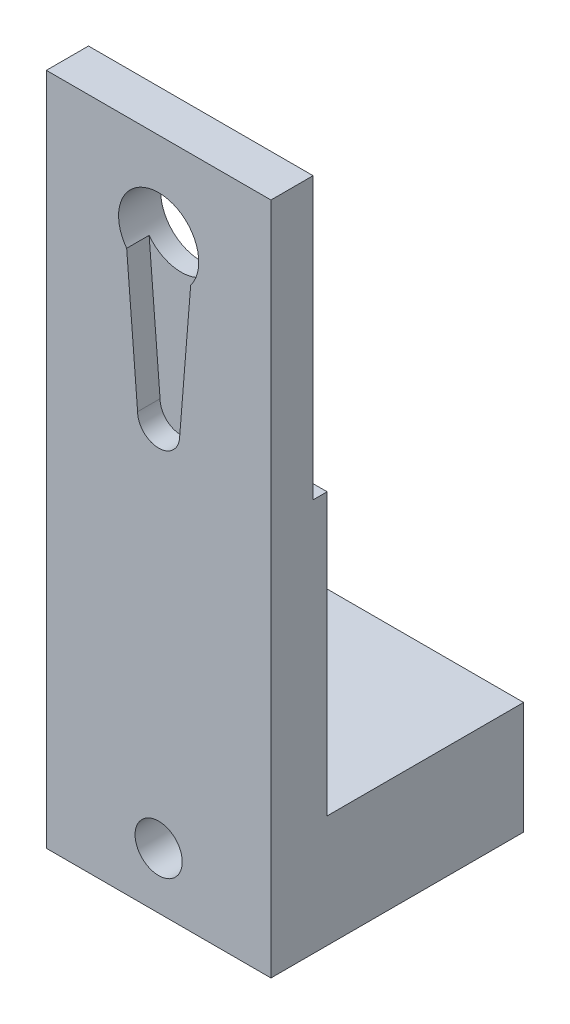
ISO-10303-21;
HEADER;
FILE_DESCRIPTION(('STEP AP214'),'2;1');
FILE_NAME('part.step','',(''),(''),'','','');
FILE_SCHEMA(('AUTOMOTIVE_DESIGN { 1 0 10303 214 1 1 1 1 }'));
ENDSEC;
DATA;
#1=APPLICATION_CONTEXT('core data for automotive mechanical design processes');
#2=APPLICATION_PROTOCOL_DEFINITION('international standard','automotive_design',2000,#1);
#3=PRODUCT_CONTEXT('',#1,'mechanical');
#4=PRODUCT('Part','Part','',(#3));
#5=PRODUCT_RELATED_PRODUCT_CATEGORY('part','',(#4));
#6=PRODUCT_DEFINITION_FORMATION('','',#4);
#7=PRODUCT_DEFINITION_CONTEXT('part definition',#1,'design');
#8=PRODUCT_DEFINITION('design','',#6,#7);
#9=PRODUCT_DEFINITION_SHAPE('','',#8);
#10=(LENGTH_UNIT() NAMED_UNIT(*) SI_UNIT(.MILLI.,.METRE.));
#11=(NAMED_UNIT(*) PLANE_ANGLE_UNIT() SI_UNIT($,.RADIAN.));
#12=(NAMED_UNIT(*) SI_UNIT($,.STERADIAN.) SOLID_ANGLE_UNIT());
#13=UNCERTAINTY_MEASURE_WITH_UNIT(LENGTH_MEASURE(1.E-05),#10,'distance_accuracy_value','');
#14=(GEOMETRIC_REPRESENTATION_CONTEXT(3) GLOBAL_UNCERTAINTY_ASSIGNED_CONTEXT((#13)) GLOBAL_UNIT_ASSIGNED_CONTEXT((#10,
#11,#12)) REPRESENTATION_CONTEXT('',''));
#15=CARTESIAN_POINT('',(0.,0.,0.));
#16=DIRECTION('',(0.,0.,1.));
#17=DIRECTION('',(1.,0.,0.));
#18=AXIS2_PLACEMENT_3D('',#15,#16,#17);
#19=CARTESIAN_POINT('',(0.,0.,0.));
#20=DIRECTION('',(0.,0.,1.));
#21=DIRECTION('',(1.,0.,0.));
#22=AXIS2_PLACEMENT_3D('',#19,#20,#21);
#23=PLANE('',#22);
#24=DIRECTION('',(0.,-1.,0.));
#25=VECTOR('',#24,1.);
#26=CARTESIAN_POINT('',(-10.,30.,0.));
#27=LINE('',#26,#25);
#28=CARTESIAN_POINT('',(-10.,4.99999999999999,0.));
#29=VERTEX_POINT('',#28);
#30=CARTESIAN_POINT('',(-10.,-20.,0.));
#31=VERTEX_POINT('',#30);
#32=EDGE_CURVE('E69',#29,#31,#27,.T.);
#33=ORIENTED_EDGE('',*,*,#32,.F.);
#34=DIRECTION('',(1.,0.,0.));
#35=VECTOR('',#34,1.);
#36=CARTESIAN_POINT('',(-20.,4.99999999999999,0.));
#37=LINE('',#36,#35);
#38=CARTESIAN_POINT('',(10.,4.99999999999999,0.));
#39=VERTEX_POINT('',#38);
#40=EDGE_CURVE('E163',#29,#39,#37,.T.);
#41=ORIENTED_EDGE('',*,*,#40,.T.);
#42=DIRECTION('',(0.,1.,0.));
#43=VECTOR('',#42,1.);
#44=CARTESIAN_POINT('',(10.,30.,0.));
#45=LINE('',#44,#43);
#46=CARTESIAN_POINT('',(10.,-20.,0.));
#47=VERTEX_POINT('',#46);
#48=EDGE_CURVE('E222',#47,#39,#45,.T.);
#49=ORIENTED_EDGE('',*,*,#48,.F.);
#50=DIRECTION('',(1.,0.,0.));
#51=VECTOR('',#50,1.);
#52=CARTESIAN_POINT('',(-10.,-20.,0.));
#53=LINE('',#52,#51);
#54=EDGE_CURVE('E179',#31,#47,#53,.T.);
#55=ORIENTED_EDGE('',*,*,#54,.F.);
#56=EDGE_LOOP('',(#33,#41,#49,#55));
#57=FACE_BOUND('',#56,.T.);
#58=ADVANCED_FACE('F47',(#57),#23,.F.);
#59=CARTESIAN_POINT('',(10.,30.,5.));
#60=DIRECTION('',(-1.,0.,0.));
#61=DIRECTION('',(0.,-1.,0.));
#62=AXIS2_PLACEMENT_3D('',#59,#60,#61);
#63=PLANE('',#62);
#64=ORIENTED_EDGE('',*,*,#48,.T.);
#65=DIRECTION('',(0.,0.,-1.));
#66=VECTOR('',#65,1.);
#67=CARTESIAN_POINT('',(10.,4.99999999999999,0.));
#68=LINE('',#67,#66);
#69=CARTESIAN_POINT('',(10.,4.99999999999999,1.25));
#70=VERTEX_POINT('',#69);
#71=EDGE_CURVE('E146',#70,#39,#68,.T.);
#72=ORIENTED_EDGE('',*,*,#71,.F.);
#73=DIRECTION('',(0.,-1.,0.));
#74=VECTOR('',#73,1.);
#75=CARTESIAN_POINT('',(10.,30.,1.25));
#76=LINE('',#75,#74);
#77=CARTESIAN_POINT('',(10.,30.,1.25));
#78=VERTEX_POINT('',#77);
#79=EDGE_CURVE('E138',#78,#70,#76,.T.);
#80=ORIENTED_EDGE('',*,*,#79,.F.);
#81=DIRECTION('',(0.,0.,-1.));
#82=VECTOR('',#81,1.);
#83=CARTESIAN_POINT('',(10.,30.,5.));
#84=LINE('',#83,#82);
#85=CARTESIAN_POINT('',(10.,30.,5.));
#86=VERTEX_POINT('',#85);
#87=EDGE_CURVE('E55',#86,#78,#84,.T.);
#88=ORIENTED_EDGE('',*,*,#87,.F.);
#89=DIRECTION('',(0.,1.,0.));
#90=VECTOR('',#89,1.);
#91=CARTESIAN_POINT('',(10.,30.,5.));
#92=LINE('',#91,#90);
#93=CARTESIAN_POINT('',(10.,-30.,5.));
#94=VERTEX_POINT('',#93);
#95=EDGE_CURVE('E231',#94,#86,#92,.T.);
#96=ORIENTED_EDGE('',*,*,#95,.F.);
#97=DIRECTION('',(0.,0.,-1.));
#98=VECTOR('',#97,1.);
#99=CARTESIAN_POINT('',(10.,-30.,5.));
#100=LINE('',#99,#98);
#101=CARTESIAN_POINT('',(10.,-30.,-17.5));
#102=VERTEX_POINT('',#101);
#103=EDGE_CURVE('E238',#94,#102,#100,.T.);
#104=ORIENTED_EDGE('',*,*,#103,.T.);
#105=DIRECTION('',(0.,-1.,0.));
#106=VECTOR('',#105,1.);
#107=CARTESIAN_POINT('',(10.,-30.,-17.5));
#108=LINE('',#107,#106);
#109=CARTESIAN_POINT('',(10.,-20.,-17.5));
#110=VERTEX_POINT('',#109);
#111=EDGE_CURVE('E185',#110,#102,#108,.T.);
#112=ORIENTED_EDGE('',*,*,#111,.F.);
#113=DIRECTION('',(0.,0.,1.));
#114=VECTOR('',#113,1.);
#115=CARTESIAN_POINT('',(10.,-20.,-17.5));
#116=LINE('',#115,#114);
#117=EDGE_CURVE('E191',#110,#47,#116,.T.);
#118=ORIENTED_EDGE('',*,*,#117,.T.);
#119=EDGE_LOOP('',(#64,#72,#80,#88,#96,#104,#112,#118));
#120=FACE_BOUND('',#119,.T.);
#121=ADVANCED_FACE('F49',(#120),#63,.F.);
#122=CARTESIAN_POINT('',(-10.,30.,5.));
#123=DIRECTION('',(0.,-1.,0.));
#124=DIRECTION('',(0.,0.,-1.));
#125=AXIS2_PLACEMENT_3D('',#122,#123,#124);
#126=PLANE('',#125);
#127=ORIENTED_EDGE('',*,*,#87,.T.);
#128=DIRECTION('',(1.,0.,0.));
#129=VECTOR('',#128,1.);
#130=CARTESIAN_POINT('',(-20.,30.,1.25));
#131=LINE('',#130,#129);
#132=CARTESIAN_POINT('',(-10.,30.,1.25));
#133=VERTEX_POINT('',#132);
#134=EDGE_CURVE('E135',#133,#78,#131,.T.);
#135=ORIENTED_EDGE('',*,*,#134,.F.);
#136=DIRECTION('',(0.,0.,-1.));
#137=VECTOR('',#136,1.);
#138=CARTESIAN_POINT('',(-10.,30.,5.));
#139=LINE('',#138,#137);
#140=CARTESIAN_POINT('',(-10.,30.,5.));
#141=VERTEX_POINT('',#140);
#142=EDGE_CURVE('E156',#141,#133,#139,.T.);
#143=ORIENTED_EDGE('',*,*,#142,.F.);
#144=DIRECTION('',(-1.,0.,0.));
#145=VECTOR('',#144,1.);
#146=CARTESIAN_POINT('',(-10.,30.,5.));
#147=LINE('',#146,#145);
#148=EDGE_CURVE('E154',#86,#141,#147,.T.);
#149=ORIENTED_EDGE('',*,*,#148,.F.);
#150=EDGE_LOOP('',(#127,#135,#143,#149));
#151=FACE_BOUND('',#150,.T.);
#152=ADVANCED_FACE('F153',(#151),#126,.F.);
#153=CARTESIAN_POINT('',(-10.,30.,5.));
#154=DIRECTION('',(1.,0.,0.));
#155=DIRECTION('',(0.,1.,0.));
#156=AXIS2_PLACEMENT_3D('',#153,#154,#155);
#157=PLANE('',#156);
#158=DIRECTION('',(0.,-1.,0.));
#159=VECTOR('',#158,1.);
#160=CARTESIAN_POINT('',(-10.,30.,1.25));
#161=LINE('',#160,#159);
#162=CARTESIAN_POINT('',(-10.,4.99999999999999,1.25));
#163=VERTEX_POINT('',#162);
#164=EDGE_CURVE('E141',#133,#163,#161,.T.);
#165=ORIENTED_EDGE('',*,*,#164,.T.);
#166=DIRECTION('',(0.,0.,-1.));
#167=VECTOR('',#166,1.);
#168=CARTESIAN_POINT('',(-10.,4.99999999999999,4.99999999999998));
#169=LINE('',#168,#167);
#170=EDGE_CURVE('E12',#163,#29,#169,.T.);
#171=ORIENTED_EDGE('',*,*,#170,.T.);
#172=ORIENTED_EDGE('',*,*,#32,.T.);
#173=DIRECTION('',(0.,0.,1.));
#174=VECTOR('',#173,1.);
#175=CARTESIAN_POINT('',(-10.,-20.,-17.5));
#176=LINE('',#175,#174);
#177=CARTESIAN_POINT('',(-10.,-20.,-17.5));
#178=VERTEX_POINT('',#177);
#179=EDGE_CURVE('E196',#178,#31,#176,.T.);
#180=ORIENTED_EDGE('',*,*,#179,.F.);
#181=DIRECTION('',(0.,1.,0.));
#182=VECTOR('',#181,1.);
#183=CARTESIAN_POINT('',(-10.,-30.,-17.5));
#184=LINE('',#183,#182);
#185=CARTESIAN_POINT('',(-10.,-30.,-17.5));
#186=VERTEX_POINT('',#185);
#187=EDGE_CURVE('E180',#186,#178,#184,.T.);
#188=ORIENTED_EDGE('',*,*,#187,.F.);
#189=DIRECTION('',(0.,0.,-1.));
#190=VECTOR('',#189,1.);
#191=CARTESIAN_POINT('',(-10.,-30.,5.));
#192=LINE('',#191,#190);
#193=CARTESIAN_POINT('',(-10.,-30.,5.));
#194=VERTEX_POINT('',#193);
#195=EDGE_CURVE('E158',#194,#186,#192,.T.);
#196=ORIENTED_EDGE('',*,*,#195,.F.);
#197=DIRECTION('',(0.,-1.,0.));
#198=VECTOR('',#197,1.);
#199=CARTESIAN_POINT('',(-10.,30.,5.));
#200=LINE('',#199,#198);
#201=EDGE_CURVE('E234',#141,#194,#200,.T.);
#202=ORIENTED_EDGE('',*,*,#201,.F.);
#203=ORIENTED_EDGE('',*,*,#142,.T.);
#204=EDGE_LOOP('',(#165,#171,#172,#180,#188,#196,#202,#203));
#205=FACE_BOUND('',#204,.T.);
#206=ADVANCED_FACE('F252',(#205),#157,.F.);
#207=CARTESIAN_POINT('',(-10.,-30.,5.));
#208=DIRECTION('',(0.,1.,0.));
#209=DIRECTION('',(0.,0.,1.));
#210=AXIS2_PLACEMENT_3D('',#207,#208,#209);
#211=PLANE('',#210);
#212=ORIENTED_EDGE('',*,*,#195,.T.);
#213=DIRECTION('',(-1.,0.,0.));
#214=VECTOR('',#213,1.);
#215=CARTESIAN_POINT('',(-10.,-30.,-17.5));
#216=LINE('',#215,#214);
#217=EDGE_CURVE('E188',#102,#186,#216,.T.);
#218=ORIENTED_EDGE('',*,*,#217,.F.);
#219=ORIENTED_EDGE('',*,*,#103,.F.);
#220=DIRECTION('',(1.,0.,0.));
#221=VECTOR('',#220,1.);
#222=CARTESIAN_POINT('',(-10.,-30.,5.));
#223=LINE('',#222,#221);
#224=EDGE_CURVE('E236',#194,#94,#223,.T.);
#225=ORIENTED_EDGE('',*,*,#224,.F.);
#226=EDGE_LOOP('',(#212,#218,#219,#225));
#227=FACE_BOUND('',#226,.T.);
#228=ADVANCED_FACE('F245',(#227),#211,.F.);
#229=CARTESIAN_POINT('',(0.,0.,5.));
#230=DIRECTION('',(0.,0.,1.));
#231=DIRECTION('',(1.,0.,0.));
#232=AXIS2_PLACEMENT_3D('',#229,#230,#231);
#233=PLANE('',#232);
#234=CARTESIAN_POINT('',(0.,-25.,5.));
#235=DIRECTION('',(0.,0.,1.));
#236=DIRECTION('',(1.,0.,0.));
#237=AXIS2_PLACEMENT_3D('',#234,#235,#236);
#238=CIRCLE('',#237,2.1);
#239=CARTESIAN_POINT('',(2.1,-25.,5.));
#240=VERTEX_POINT('',#239);
#241=EDGE_CURVE('E176',#240,#240,#238,.T.);
#242=ORIENTED_EDGE('',*,*,#241,.F.);
#243=EDGE_LOOP('',(#242));
#244=FACE_BOUND('',#243,.T.);
#245=CARTESIAN_POINT('',(0.,7.73920680947335,5.));
#246=DIRECTION('',(0.,0.,1.));
#247=DIRECTION('',(1.,0.,0.));
#248=AXIS2_PLACEMENT_3D('',#245,#246,#247);
#249=CIRCLE('',#248,1.875);
#250=CARTESIAN_POINT('',(-1.87499999999999,7.73920680947335,5.));
#251=VERTEX_POINT('',#250);
#252=CARTESIAN_POINT('',(1.87500000000001,7.73920680947335,5.));
#253=VERTEX_POINT('',#252);
#254=EDGE_CURVE('E212',#251,#253,#249,.T.);
#255=ORIENTED_EDGE('',*,*,#254,.F.);
#256=DIRECTION('',(0.0802469135802469,-0.996775016170071,0.));
#257=VECTOR('',#256,1.);
#258=CARTESIAN_POINT('',(-1.24388121961079,-0.10014058048699,5.));
#259=LINE('',#258,#257);
#260=CARTESIAN_POINT('',(-2.84999999999999,19.8500232559397,5.));
#261=VERTEX_POINT('',#260);
#262=EDGE_CURVE('E206',#261,#251,#259,.T.);
#263=ORIENTED_EDGE('',*,*,#262,.F.);
#264=CARTESIAN_POINT('',(0.,22.,5.));
#265=DIRECTION('',(0.,0.,1.));
#266=DIRECTION('',(1.,0.,0.));
#267=AXIS2_PLACEMENT_3D('',#264,#265,#266);
#268=CIRCLE('',#267,3.57);
#269=CARTESIAN_POINT('',(2.85,19.8500232559397,5.));
#270=VERTEX_POINT('',#269);
#271=EDGE_CURVE('E201',#270,#261,#268,.T.);
#272=ORIENTED_EDGE('',*,*,#271,.F.);
#273=DIRECTION('',(-0.0802469135802469,-0.996775016170071,0.));
#274=VECTOR('',#273,1.);
#275=CARTESIAN_POINT('',(1.2438812196108,-0.100140580486991,5.));
#276=LINE('',#275,#274);
#277=EDGE_CURVE('E215',#270,#253,#276,.T.);
#278=ORIENTED_EDGE('',*,*,#277,.T.);
#279=EDGE_LOOP('',(#255,#263,#272,#278));
#280=FACE_BOUND('',#279,.T.);
#281=ORIENTED_EDGE('',*,*,#95,.T.);
#282=ORIENTED_EDGE('',*,*,#148,.T.);
#283=ORIENTED_EDGE('',*,*,#201,.T.);
#284=ORIENTED_EDGE('',*,*,#224,.T.);
#285=EDGE_LOOP('',(#281,#282,#283,#284));
#286=FACE_BOUND('',#285,.T.);
#287=ADVANCED_FACE('F257',(#244,#280,#286),#233,.T.);
#288=CARTESIAN_POINT('',(0.,7.73920680947335,3.));
#289=DIRECTION('',(0.,0.,1.));
#290=DIRECTION('',(1.,0.,0.));
#291=AXIS2_PLACEMENT_3D('',#288,#289,#290);
#292=CYLINDRICAL_SURFACE('',#291,1.875);
#293=ORIENTED_EDGE('',*,*,#254,.T.);
#294=DIRECTION('',(0.,0.,1.));
#295=VECTOR('',#294,1.);
#296=CARTESIAN_POINT('',(1.87500000000001,7.73920680947335,3.));
#297=LINE('',#296,#295);
#298=CARTESIAN_POINT('',(1.87500000000001,7.73920680947335,3.));
#299=VERTEX_POINT('',#298);
#300=EDGE_CURVE('E211',#299,#253,#297,.T.);
#301=ORIENTED_EDGE('',*,*,#300,.F.);
#302=CARTESIAN_POINT('',(0.,7.73920680947335,3.));
#303=DIRECTION('',(0.,0.,1.));
#304=DIRECTION('',(1.,0.,0.));
#305=AXIS2_PLACEMENT_3D('',#302,#303,#304);
#306=CIRCLE('',#305,1.875);
#307=CARTESIAN_POINT('',(-1.87499999999999,7.73920680947335,3.));
#308=VERTEX_POINT('',#307);
#309=EDGE_CURVE('E202',#308,#299,#306,.T.);
#310=ORIENTED_EDGE('',*,*,#309,.F.);
#311=DIRECTION('',(0.,0.,1.));
#312=VECTOR('',#311,1.);
#313=CARTESIAN_POINT('',(-1.87499999999999,7.73920680947335,3.));
#314=LINE('',#313,#312);
#315=EDGE_CURVE('E220',#308,#251,#314,.T.);
#316=ORIENTED_EDGE('',*,*,#315,.T.);
#317=EDGE_LOOP('',(#293,#301,#310,#316));
#318=FACE_BOUND('',#317,.T.);
#319=ADVANCED_FACE('F292',(#318),#292,.F.);
#320=CARTESIAN_POINT('',(-1.24388121961079,-0.10014058048699,3.));
#321=DIRECTION('',(-0.996775016170071,-0.0802469135802469,0.));
#322=DIRECTION('',(0.0802469135802469,-0.996775016170071,0.));
#323=AXIS2_PLACEMENT_3D('',#320,#321,#322);
#324=PLANE('',#323);
#325=ORIENTED_EDGE('',*,*,#262,.T.);
#326=ORIENTED_EDGE('',*,*,#315,.F.);
#327=DIRECTION('',(0.0802469135802469,-0.996775016170071,0.));
#328=VECTOR('',#327,1.);
#329=CARTESIAN_POINT('',(-1.24388121961079,-0.10014058048699,3.));
#330=LINE('',#329,#328);
#331=CARTESIAN_POINT('',(-2.85,19.8500232559397,3.));
#332=VERTEX_POINT('',#331);
#333=EDGE_CURVE('E208',#332,#308,#330,.T.);
#334=ORIENTED_EDGE('',*,*,#333,.F.);
#335=DIRECTION('',(0.,0.,1.));
#336=VECTOR('',#335,1.);
#337=CARTESIAN_POINT('',(-2.84999999999999,19.8500232559397,3.));
#338=LINE('',#337,#336);
#339=EDGE_CURVE('E223',#332,#261,#338,.T.);
#340=ORIENTED_EDGE('',*,*,#339,.T.);
#341=EDGE_LOOP('',(#325,#326,#334,#340));
#342=FACE_BOUND('',#341,.T.);
#343=ADVANCED_FACE('F301',(#342),#324,.F.);
#344=CARTESIAN_POINT('',(1.2438812196108,-0.100140580486991,3.));
#345=DIRECTION('',(-0.996775016170071,0.0802469135802469,0.));
#346=DIRECTION('',(-0.0802469135802469,-0.996775016170071,0.));
#347=AXIS2_PLACEMENT_3D('',#344,#345,#346);
#348=PLANE('',#347);
#349=ORIENTED_EDGE('',*,*,#277,.F.);
#350=DIRECTION('',(0.,0.,1.));
#351=VECTOR('',#350,1.);
#352=CARTESIAN_POINT('',(2.85000000000001,19.8500232559397,3.));
#353=LINE('',#352,#351);
#354=CARTESIAN_POINT('',(2.85000000000001,19.8500232559397,3.));
#355=VERTEX_POINT('',#354);
#356=EDGE_CURVE('E225',#355,#270,#353,.T.);
#357=ORIENTED_EDGE('',*,*,#356,.F.);
#358=DIRECTION('',(-0.0802469135802469,-0.996775016170071,0.));
#359=VECTOR('',#358,1.);
#360=CARTESIAN_POINT('',(1.2438812196108,-0.100140580486991,3.));
#361=LINE('',#360,#359);
#362=EDGE_CURVE('E205',#355,#299,#361,.T.);
#363=ORIENTED_EDGE('',*,*,#362,.T.);
#364=ORIENTED_EDGE('',*,*,#300,.T.);
#365=EDGE_LOOP('',(#349,#357,#363,#364));
#366=FACE_BOUND('',#365,.T.);
#367=ADVANCED_FACE('F309',(#366),#348,.T.);
#368=CARTESIAN_POINT('',(0.,0.,3.));
#369=DIRECTION('',(0.,0.,1.));
#370=DIRECTION('',(1.,0.,0.));
#371=AXIS2_PLACEMENT_3D('',#368,#369,#370);
#372=PLANE('',#371);
#373=CARTESIAN_POINT('',(0.,22.,3.));
#374=DIRECTION('',(0.,0.,1.));
#375=DIRECTION('',(1.,0.,0.));
#376=AXIS2_PLACEMENT_3D('',#373,#374,#375);
#377=CIRCLE('',#376,3.57);
#378=EDGE_CURVE('E199',#332,#355,#377,.T.);
#379=ORIENTED_EDGE('',*,*,#378,.F.);
#380=ORIENTED_EDGE('',*,*,#333,.T.);
#381=ORIENTED_EDGE('',*,*,#309,.T.);
#382=ORIENTED_EDGE('',*,*,#362,.F.);
#383=EDGE_LOOP('',(#379,#380,#381,#382));
#384=FACE_BOUND('',#383,.T.);
#385=ADVANCED_FACE('F317',(#384),#372,.T.);
#386=CARTESIAN_POINT('',(0.,22.,3.));
#387=DIRECTION('',(0.,0.,1.));
#388=DIRECTION('',(1.,0.,0.));
#389=AXIS2_PLACEMENT_3D('',#386,#387,#388);
#390=CYLINDRICAL_SURFACE('',#389,3.57);
#391=CARTESIAN_POINT('',(0.,22.,1.25));
#392=DIRECTION('',(0.,0.,1.));
#393=DIRECTION('',(0.,-1.,0.));
#394=AXIS2_PLACEMENT_3D('',#391,#392,#393);
#395=CIRCLE('',#394,3.57);
#396=CARTESIAN_POINT('',(0.,18.43,1.25));
#397=VERTEX_POINT('',#396);
#398=EDGE_CURVE('E161',#397,#397,#395,.F.);
#399=ORIENTED_EDGE('',*,*,#398,.T.);
#400=EDGE_LOOP('',(#399));
#401=FACE_BOUND('',#400,.T.);
#402=ORIENTED_EDGE('',*,*,#339,.F.);
#403=ORIENTED_EDGE('',*,*,#378,.T.);
#404=ORIENTED_EDGE('',*,*,#356,.T.);
#405=ORIENTED_EDGE('',*,*,#271,.T.);
#406=EDGE_LOOP('',(#402,#403,#404,#405));
#407=FACE_BOUND('',#406,.T.);
#408=ADVANCED_FACE('F294',(#401,#407),#390,.F.);
#409=CARTESIAN_POINT('',(-10.,-20.,-17.5));
#410=DIRECTION('',(0.,-1.,0.));
#411=DIRECTION('',(0.,0.,-1.));
#412=AXIS2_PLACEMENT_3D('',#409,#410,#411);
#413=PLANE('',#412);
#414=ORIENTED_EDGE('',*,*,#54,.T.);
#415=ORIENTED_EDGE('',*,*,#117,.F.);
#416=DIRECTION('',(1.,0.,0.));
#417=VECTOR('',#416,1.);
#418=CARTESIAN_POINT('',(-10.,-20.,-17.5));
#419=LINE('',#418,#417);
#420=EDGE_CURVE('E183',#178,#110,#419,.T.);
#421=ORIENTED_EDGE('',*,*,#420,.F.);
#422=ORIENTED_EDGE('',*,*,#179,.T.);
#423=EDGE_LOOP('',(#414,#415,#421,#422));
#424=FACE_BOUND('',#423,.T.);
#425=ADVANCED_FACE('F254',(#424),#413,.F.);
#426=CARTESIAN_POINT('',(0.,0.,-17.5));
#427=DIRECTION('',(0.,0.,-1.));
#428=DIRECTION('',(-1.,0.,0.));
#429=AXIS2_PLACEMENT_3D('',#426,#427,#428);
#430=PLANE('',#429);
#431=CARTESIAN_POINT('',(0.,-25.,-17.5));
#432=DIRECTION('',(0.,0.,-1.));
#433=DIRECTION('',(-1.,0.,0.));
#434=AXIS2_PLACEMENT_3D('',#431,#432,#433);
#435=CIRCLE('',#434,2.1);
#436=CARTESIAN_POINT('',(-2.1,-25.,-17.5));
#437=VERTEX_POINT('',#436);
#438=EDGE_CURVE('E166',#437,#437,#435,.T.);
#439=ORIENTED_EDGE('',*,*,#438,.F.);
#440=EDGE_LOOP('',(#439));
#441=FACE_BOUND('',#440,.T.);
#442=ORIENTED_EDGE('',*,*,#187,.T.);
#443=ORIENTED_EDGE('',*,*,#420,.T.);
#444=ORIENTED_EDGE('',*,*,#111,.T.);
#445=ORIENTED_EDGE('',*,*,#217,.T.);
#446=EDGE_LOOP('',(#442,#443,#444,#445));
#447=FACE_BOUND('',#446,.T.);
#448=ADVANCED_FACE('F250',(#441,#447),#430,.T.);
#449=CARTESIAN_POINT('',(0.,-25.,22.5));
#450=DIRECTION('',(0.,0.,-1.));
#451=DIRECTION('',(-1.,0.,0.));
#452=AXIS2_PLACEMENT_3D('',#449,#450,#451);
#453=CYLINDRICAL_SURFACE('',#452,2.1);
#454=ORIENTED_EDGE('',*,*,#241,.T.);
#455=EDGE_LOOP('',(#454));
#456=FACE_BOUND('',#455,.T.);
#457=ORIENTED_EDGE('',*,*,#438,.T.);
#458=EDGE_LOOP('',(#457));
#459=FACE_BOUND('',#458,.T.);
#460=ADVANCED_FACE('F340',(#456,#459),#453,.F.);
#461=CARTESIAN_POINT('',(-20.,4.99999999999999,0.));
#462=DIRECTION('',(0.,-1.,0.));
#463=DIRECTION('',(0.,0.,-1.));
#464=AXIS2_PLACEMENT_3D('',#461,#462,#463);
#465=PLANE('',#464);
#466=DIRECTION('',(1.,0.,0.));
#467=VECTOR('',#466,1.);
#468=CARTESIAN_POINT('',(-20.,4.99999999999999,1.25));
#469=LINE('',#468,#467);
#470=EDGE_CURVE('E62',#163,#70,#469,.T.);
#471=ORIENTED_EDGE('',*,*,#470,.T.);
#472=ORIENTED_EDGE('',*,*,#71,.T.);
#473=ORIENTED_EDGE('',*,*,#40,.F.);
#474=ORIENTED_EDGE('',*,*,#170,.F.);
#475=EDGE_LOOP('',(#471,#472,#473,#474));
#476=FACE_BOUND('',#475,.T.);
#477=ADVANCED_FACE('F348',(#476),#465,.F.);
#478=CARTESIAN_POINT('',(-20.,30.,1.25));
#479=DIRECTION('',(0.,0.,1.));
#480=DIRECTION('',(0.,-1.,0.));
#481=AXIS2_PLACEMENT_3D('',#478,#479,#480);
#482=PLANE('',#481);
#483=ORIENTED_EDGE('',*,*,#398,.F.);
#484=EDGE_LOOP('',(#483));
#485=FACE_BOUND('',#484,.T.);
#486=ORIENTED_EDGE('',*,*,#134,.T.);
#487=ORIENTED_EDGE('',*,*,#79,.T.);
#488=ORIENTED_EDGE('',*,*,#470,.F.);
#489=ORIENTED_EDGE('',*,*,#164,.F.);
#490=EDGE_LOOP('',(#486,#487,#488,#489));
#491=FACE_BOUND('',#490,.T.);
#492=ADVANCED_FACE('F137',(#485,#491),#482,.F.);
#493=CLOSED_SHELL('',(#58,#121,#152,#206,#228,#287,#319,#343,#367,#385,#408,#425,#448,#460,#477,#492));
#494=MANIFOLD_SOLID_BREP('B2',#493);
#495=ADVANCED_BREP_SHAPE_REPRESENTATION('',(#18,#494),#14);
#496=SHAPE_DEFINITION_REPRESENTATION(#9,#495);
ENDSEC;
END-ISO-10303-21;
